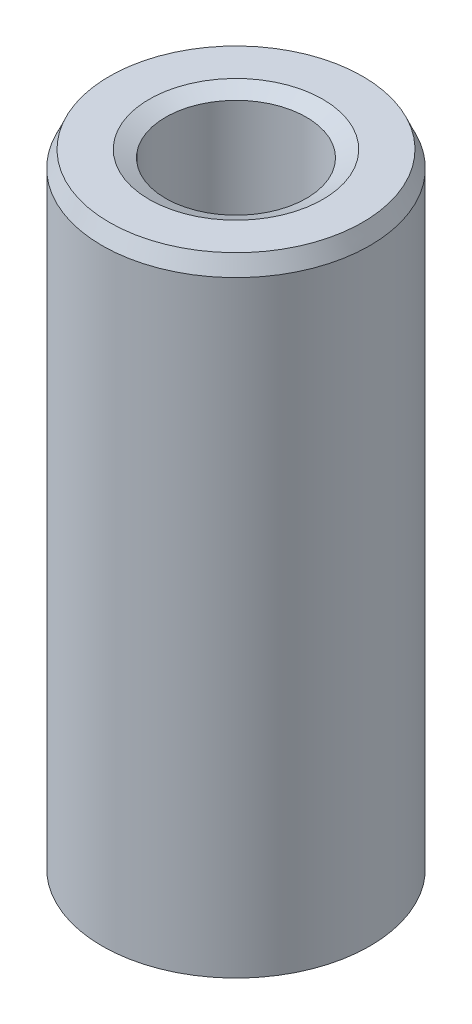
ISO-10303-21;
HEADER;
FILE_DESCRIPTION(('STEP AP214'),'2;1');
FILE_NAME('part.step','',(''),(''),'','','');
FILE_SCHEMA(('AUTOMOTIVE_DESIGN { 1 0 10303 214 1 1 1 1 }'));
ENDSEC;
DATA;
#1=APPLICATION_CONTEXT('core data for automotive mechanical design processes');
#2=APPLICATION_PROTOCOL_DEFINITION('international standard','automotive_design',2000,#1);
#3=PRODUCT_CONTEXT('',#1,'mechanical');
#4=PRODUCT('Part','Part','',(#3));
#5=PRODUCT_RELATED_PRODUCT_CATEGORY('part','',(#4));
#6=PRODUCT_DEFINITION_FORMATION('','',#4);
#7=PRODUCT_DEFINITION_CONTEXT('part definition',#1,'design');
#8=PRODUCT_DEFINITION('design','',#6,#7);
#9=PRODUCT_DEFINITION_SHAPE('','',#8);
#10=(LENGTH_UNIT() NAMED_UNIT(*) SI_UNIT(.MILLI.,.METRE.));
#11=(NAMED_UNIT(*) PLANE_ANGLE_UNIT() SI_UNIT($,.RADIAN.));
#12=(NAMED_UNIT(*) SI_UNIT($,.STERADIAN.) SOLID_ANGLE_UNIT());
#13=UNCERTAINTY_MEASURE_WITH_UNIT(LENGTH_MEASURE(1.E-05),#10,'distance_accuracy_value','');
#14=(GEOMETRIC_REPRESENTATION_CONTEXT(3) GLOBAL_UNCERTAINTY_ASSIGNED_CONTEXT((#13)) GLOBAL_UNIT_ASSIGNED_CONTEXT((#10,
#11,#12)) REPRESENTATION_CONTEXT('',''));
#15=CARTESIAN_POINT('',(0.,0.,0.));
#16=DIRECTION('',(0.,0.,1.));
#17=DIRECTION('',(1.,0.,0.));
#18=AXIS2_PLACEMENT_3D('',#15,#16,#17);
#19=CARTESIAN_POINT('',(0.,117.685645552562,0.));
#20=DIRECTION('',(0.,-1.,0.));
#21=DIRECTION('',(0.,0.,-1.));
#22=AXIS2_PLACEMENT_3D('',#19,#20,#21);
#23=CYLINDRICAL_SURFACE('',#22,25.);
#24=CARTESIAN_POINT('',(0.,1.36505654363379,0.));
#25=DIRECTION('',(0.,1.,0.));
#26=DIRECTION('',(0.,0.,1.));
#27=AXIS2_PLACEMENT_3D('',#24,#25,#26);
#28=CIRCLE('',#27,25.);
#29=CARTESIAN_POINT('',(0.,1.36505654363379,25.));
#30=VERTEX_POINT('',#29);
#31=EDGE_CURVE('E10',#30,#30,#28,.T.);
#32=ORIENTED_EDGE('',*,*,#31,.T.);
#33=EDGE_LOOP('',(#32));
#34=FACE_BOUND('',#33,.T.);
#35=CARTESIAN_POINT('',(0.,114.617251153448,0.));
#36=DIRECTION('',(0.,1.,0.));
#37=DIRECTION('',(0.,0.,1.));
#38=AXIS2_PLACEMENT_3D('',#35,#36,#37);
#39=CIRCLE('',#38,25.);
#40=CARTESIAN_POINT('',(0.,114.617251153448,25.));
#41=VERTEX_POINT('',#40);
#42=EDGE_CURVE('E50',#41,#41,#39,.F.);
#43=ORIENTED_EDGE('',*,*,#42,.T.);
#44=EDGE_LOOP('',(#43));
#45=FACE_BOUND('',#44,.T.);
#46=ADVANCED_FACE('F39',(#34,#45),#23,.T.);
#47=CARTESIAN_POINT('',(0.,117.685645552562,0.));
#48=DIRECTION('',(0.,1.,0.));
#49=DIRECTION('',(0.,0.,1.));
#50=AXIS2_PLACEMENT_3D('',#47,#48,#49);
#51=PLANE('',#50);
#52=CARTESIAN_POINT('',(0.,117.685645552562,0.));
#53=DIRECTION('',(0.,1.,0.));
#54=DIRECTION('',(0.,0.,1.));
#55=AXIS2_PLACEMENT_3D('',#52,#53,#54);
#56=CIRCLE('',#55,16.2087242137754);
#57=CARTESIAN_POINT('',(0.,117.685645552562,16.2087242137754));
#58=VERTEX_POINT('',#57);
#59=EDGE_CURVE('E58',#58,#58,#56,.F.);
#60=ORIENTED_EDGE('',*,*,#59,.T.);
#61=EDGE_LOOP('',(#60));
#62=FACE_BOUND('',#61,.T.);
#63=CARTESIAN_POINT('',(0.,117.685645552562,0.));
#64=DIRECTION('',(0.,1.,0.));
#65=DIRECTION('',(0.,0.,1.));
#66=AXIS2_PLACEMENT_3D('',#63,#64,#65);
#67=CIRCLE('',#66,23.6349434563662);
#68=CARTESIAN_POINT('',(0.,117.685645552562,23.6349434563662));
#69=VERTEX_POINT('',#68);
#70=EDGE_CURVE('E61',#69,#69,#67,.T.);
#71=ORIENTED_EDGE('',*,*,#70,.T.);
#72=EDGE_LOOP('',(#71));
#73=FACE_BOUND('',#72,.T.);
#74=ADVANCED_FACE('F88',(#62,#73),#51,.T.);
#75=CARTESIAN_POINT('',(0.,0.,0.));
#76=DIRECTION('',(0.,1.,0.));
#77=DIRECTION('',(0.,0.,1.));
#78=AXIS2_PLACEMENT_3D('',#75,#76,#77);
#79=PLANE('',#78);
#80=CARTESIAN_POINT('',(0.,0.,0.));
#81=DIRECTION('',(0.,1.,0.));
#82=DIRECTION('',(0.,0.,1.));
#83=AXIS2_PLACEMENT_3D('',#80,#81,#82);
#84=CIRCLE('',#83,14.5053863582955);
#85=CARTESIAN_POINT('',(0.,0.,14.5053863582955));
#86=VERTEX_POINT('',#85);
#87=EDGE_CURVE('E51',#86,#86,#84,.T.);
#88=ORIENTED_EDGE('',*,*,#87,.T.);
#89=EDGE_LOOP('',(#88));
#90=FACE_BOUND('',#89,.T.);
#91=CARTESIAN_POINT('',(0.,0.,0.));
#92=DIRECTION('',(0.,1.,0.));
#93=DIRECTION('',(0.,0.,1.));
#94=AXIS2_PLACEMENT_3D('',#91,#92,#93);
#95=CIRCLE('',#94,21.9316056008863);
#96=CARTESIAN_POINT('',(0.,0.,21.9316056008863));
#97=VERTEX_POINT('',#96);
#98=EDGE_CURVE('E54',#97,#97,#95,.F.);
#99=ORIENTED_EDGE('',*,*,#98,.T.);
#100=EDGE_LOOP('',(#99));
#101=FACE_BOUND('',#100,.T.);
#102=ADVANCED_FACE('F83',(#90,#101),#79,.F.);
#103=CARTESIAN_POINT('',(0.,117.685645552562,0.));
#104=DIRECTION('',(0.,-1.,0.));
#105=DIRECTION('',(0.,0.,-1.));
#106=AXIS2_PLACEMENT_3D('',#103,#104,#105);
#107=CYLINDRICAL_SURFACE('',#106,13.1403298146617);
#108=CARTESIAN_POINT('',(0.,116.320589008928,0.));
#109=DIRECTION('',(0.,1.,0.));
#110=DIRECTION('',(0.,0.,1.));
#111=AXIS2_PLACEMENT_3D('',#108,#109,#110);
#112=CIRCLE('',#111,13.1403298146617);
#113=CARTESIAN_POINT('',(0.,116.320589008928,13.1403298146617));
#114=VERTEX_POINT('',#113);
#115=EDGE_CURVE('E67',#114,#114,#112,.T.);
#116=ORIENTED_EDGE('',*,*,#115,.T.);
#117=EDGE_LOOP('',(#116));
#118=FACE_BOUND('',#117,.T.);
#119=CARTESIAN_POINT('',(0.,3.0683943991137,0.));
#120=DIRECTION('',(0.,1.,0.));
#121=DIRECTION('',(0.,0.,1.));
#122=AXIS2_PLACEMENT_3D('',#119,#120,#121);
#123=CIRCLE('',#122,13.1403298146617);
#124=CARTESIAN_POINT('',(0.,3.0683943991137,13.1403298146617));
#125=VERTEX_POINT('',#124);
#126=EDGE_CURVE('E69',#125,#125,#123,.F.);
#127=ORIENTED_EDGE('',*,*,#126,.T.);
#128=EDGE_LOOP('',(#127));
#129=FACE_BOUND('',#128,.T.);
#130=ADVANCED_FACE('F71',(#118,#129),#107,.F.);
#131=CARTESIAN_POINT('',(0.,116.320589008928,0.));
#132=DIRECTION('',(0.,1.,0.));
#133=DIRECTION('',(0.,0.,1.));
#134=AXIS2_PLACEMENT_3D('',#131,#132,#133);
#135=CONICAL_SURFACE('',#134,13.1403298146617,1.15221127111158);
#136=ORIENTED_EDGE('',*,*,#59,.F.);
#137=EDGE_LOOP('',(#136));
#138=FACE_BOUND('',#137,.T.);
#139=ORIENTED_EDGE('',*,*,#115,.F.);
#140=EDGE_LOOP('',(#139));
#141=FACE_BOUND('',#140,.T.);
#142=ADVANCED_FACE('F77',(#138,#141),#135,.F.);
#143=CARTESIAN_POINT('',(0.,0.,0.));
#144=DIRECTION('',(0.,-1.,0.));
#145=DIRECTION('',(0.,0.,-1.));
#146=AXIS2_PLACEMENT_3D('',#143,#144,#145);
#147=CONICAL_SURFACE('',#146,14.5053863582955,0.418585055683313);
#148=ORIENTED_EDGE('',*,*,#126,.F.);
#149=EDGE_LOOP('',(#148));
#150=FACE_BOUND('',#149,.T.);
#151=ORIENTED_EDGE('',*,*,#87,.F.);
#152=EDGE_LOOP('',(#151));
#153=FACE_BOUND('',#152,.T.);
#154=ADVANCED_FACE('F73',(#150,#153),#147,.F.);
#155=CARTESIAN_POINT('',(0.,1.36505654363379,0.));
#156=DIRECTION('',(0.,1.,0.));
#157=DIRECTION('',(0.,0.,1.));
#158=AXIS2_PLACEMENT_3D('',#155,#156,#157);
#159=CONICAL_SURFACE('',#158,25.,1.15221127111158);
#160=ORIENTED_EDGE('',*,*,#98,.F.);
#161=EDGE_LOOP('',(#160));
#162=FACE_BOUND('',#161,.T.);
#163=ORIENTED_EDGE('',*,*,#31,.F.);
#164=EDGE_LOOP('',(#163));
#165=FACE_BOUND('',#164,.T.);
#166=ADVANCED_FACE('F76',(#162,#165),#159,.T.);
#167=CARTESIAN_POINT('',(0.,117.685645552562,0.));
#168=DIRECTION('',(0.,-1.,0.));
#169=DIRECTION('',(0.,0.,-1.));
#170=AXIS2_PLACEMENT_3D('',#167,#168,#169);
#171=CONICAL_SURFACE('',#170,23.6349434563662,0.418585055683311);
#172=ORIENTED_EDGE('',*,*,#42,.F.);
#173=EDGE_LOOP('',(#172));
#174=FACE_BOUND('',#173,.T.);
#175=ORIENTED_EDGE('',*,*,#70,.F.);
#176=EDGE_LOOP('',(#175));
#177=FACE_BOUND('',#176,.T.);
#178=ADVANCED_FACE('F45',(#174,#177),#171,.T.);
#179=CLOSED_SHELL('',(#46,#74,#102,#130,#142,#154,#166,#178));
#180=MANIFOLD_SOLID_BREP('B2',#179);
#181=ADVANCED_BREP_SHAPE_REPRESENTATION('',(#18,#180),#14);
#182=SHAPE_DEFINITION_REPRESENTATION(#9,#181);
ENDSEC;
END-ISO-10303-21;
